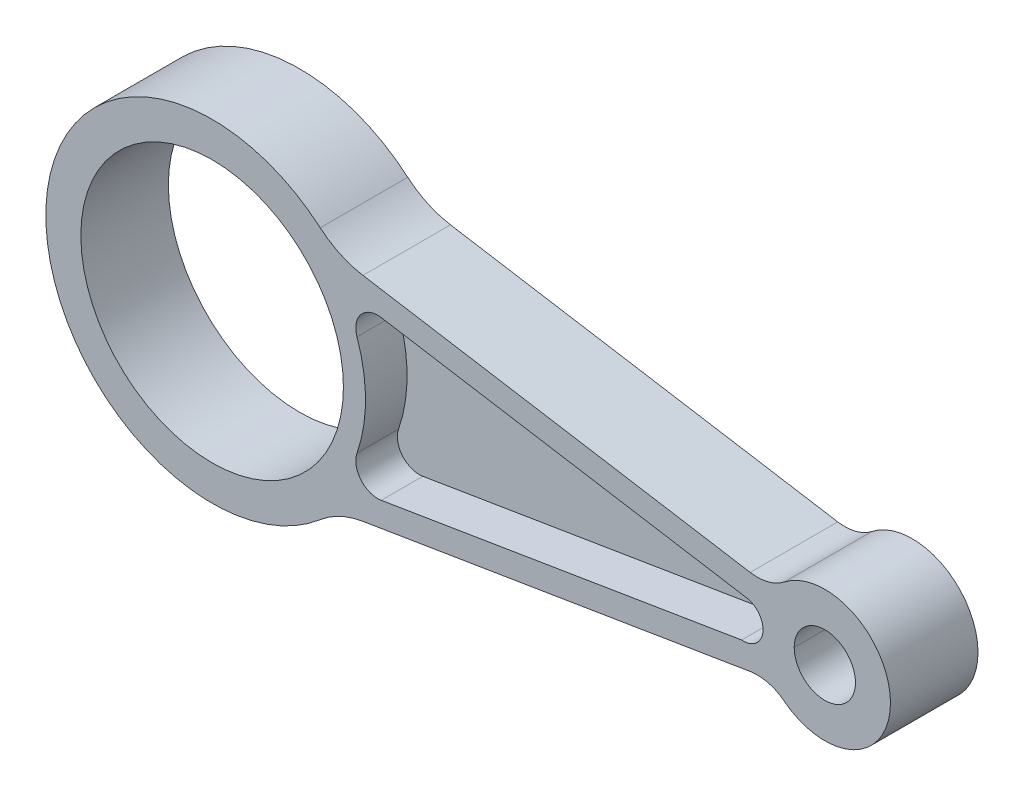
ISO-10303-21;
HEADER;
FILE_DESCRIPTION(('STEP AP214'),'2;1');
FILE_NAME('part.step','',(''),(''),'','','');
FILE_SCHEMA(('AUTOMOTIVE_DESIGN { 1 0 10303 214 1 1 1 1 }'));
ENDSEC;
DATA;
#1=APPLICATION_CONTEXT('core data for automotive mechanical design processes');
#2=APPLICATION_PROTOCOL_DEFINITION('international standard','automotive_design',2000,#1);
#3=PRODUCT_CONTEXT('',#1,'mechanical');
#4=PRODUCT('Part','Part','',(#3));
#5=PRODUCT_RELATED_PRODUCT_CATEGORY('part','',(#4));
#6=PRODUCT_DEFINITION_FORMATION('','',#4);
#7=PRODUCT_DEFINITION_CONTEXT('part definition',#1,'design');
#8=PRODUCT_DEFINITION('design','',#6,#7);
#9=PRODUCT_DEFINITION_SHAPE('','',#8);
#10=(LENGTH_UNIT() NAMED_UNIT(*) SI_UNIT(.MILLI.,.METRE.));
#11=(NAMED_UNIT(*) PLANE_ANGLE_UNIT() SI_UNIT($,.RADIAN.));
#12=(NAMED_UNIT(*) SI_UNIT($,.STERADIAN.) SOLID_ANGLE_UNIT());
#13=UNCERTAINTY_MEASURE_WITH_UNIT(LENGTH_MEASURE(1.E-05),#10,'distance_accuracy_value','');
#14=(GEOMETRIC_REPRESENTATION_CONTEXT(3) GLOBAL_UNCERTAINTY_ASSIGNED_CONTEXT((#13)) GLOBAL_UNIT_ASSIGNED_CONTEXT((#10,
#11,#12)) REPRESENTATION_CONTEXT('',''));
#15=CARTESIAN_POINT('',(0.,0.,0.));
#16=DIRECTION('',(0.,0.,1.));
#17=DIRECTION('',(1.,0.,0.));
#18=AXIS2_PLACEMENT_3D('',#15,#16,#17);
#19=CARTESIAN_POINT('',(140.,0.,10.));
#20=DIRECTION('',(0.,0.,-1.));
#21=DIRECTION('',(-1.,0.,0.));
#22=AXIS2_PLACEMENT_3D('',#19,#20,#21);
#23=CYLINDRICAL_SURFACE('',#22,7.00000000000001);
#24=CARTESIAN_POINT('',(140.,0.,10.));
#25=DIRECTION('',(0.,0.,1.));
#26=DIRECTION('',(1.,0.,0.));
#27=AXIS2_PLACEMENT_3D('',#24,#25,#26);
#28=CIRCLE('',#27,7.00000000000001);
#29=CARTESIAN_POINT('',(133.,0.,10.));
#30=VERTEX_POINT('',#29);
#31=CARTESIAN_POINT('',(147.,0.,10.));
#32=VERTEX_POINT('',#31);
#33=EDGE_CURVE('E293',#30,#32,#28,.T.);
#34=ORIENTED_EDGE('',*,*,#33,.T.);
#35=DIRECTION('',(0.,0.,-1.));
#36=VECTOR('',#35,1.);
#37=CARTESIAN_POINT('',(147.,0.,10.));
#38=LINE('',#37,#36);
#39=CARTESIAN_POINT('',(147.,0.,-10.));
#40=VERTEX_POINT('',#39);
#41=EDGE_CURVE('E11',#32,#40,#38,.T.);
#42=ORIENTED_EDGE('',*,*,#41,.T.);
#43=CARTESIAN_POINT('',(140.,0.,-10.));
#44=DIRECTION('',(0.,0.,1.));
#45=DIRECTION('',(1.,0.,0.));
#46=AXIS2_PLACEMENT_3D('',#43,#44,#45);
#47=CIRCLE('',#46,7.00000000000001);
#48=CARTESIAN_POINT('',(133.,0.,-10.));
#49=VERTEX_POINT('',#48);
#50=EDGE_CURVE('E297',#49,#40,#47,.T.);
#51=ORIENTED_EDGE('',*,*,#50,.F.);
#52=DIRECTION('',(0.,0.,1.));
#53=VECTOR('',#52,1.);
#54=CARTESIAN_POINT('',(133.,0.,10.));
#55=LINE('',#54,#53);
#56=EDGE_CURVE('E49',#49,#30,#55,.T.);
#57=ORIENTED_EDGE('',*,*,#56,.T.);
#58=EDGE_LOOP('',(#34,#42,#51,#57));
#59=FACE_BOUND('',#58,.T.);
#60=ADVANCED_FACE('F40',(#59),#23,.F.);
#61=CARTESIAN_POINT('',(0.,0.,-10.));
#62=DIRECTION('',(0.,0.,1.));
#63=DIRECTION('',(1.,0.,0.));
#64=AXIS2_PLACEMENT_3D('',#61,#62,#63);
#65=PLANE('',#64);
#66=ORIENTED_EDGE('',*,*,#50,.T.);
#67=EDGE_CURVE('E282',#40,#49,#47,.T.);
#68=ORIENTED_EDGE('',*,*,#67,.T.);
#69=EDGE_LOOP('',(#66,#68));
#70=FACE_BOUND('',#69,.T.);
#71=CARTESIAN_POINT('',(0.,0.,-10.));
#72=DIRECTION('',(0.,0.,1.));
#73=DIRECTION('',(1.,0.,0.));
#74=AXIS2_PLACEMENT_3D('',#71,#72,#73);
#75=CIRCLE('',#74,30.);
#76=CARTESIAN_POINT('',(30.,0.,-10.));
#77=VERTEX_POINT('',#76);
#78=EDGE_CURVE('E295',#77,#77,#75,.T.);
#79=ORIENTED_EDGE('',*,*,#78,.T.);
#80=EDGE_LOOP('',(#79));
#81=FACE_BOUND('',#80,.T.);
#82=CARTESIAN_POINT('',(0.,0.,-10.));
#83=DIRECTION('',(0.,0.,1.));
#84=DIRECTION('',(1.,0.,0.));
#85=AXIS2_PLACEMENT_3D('',#82,#83,#84);
#86=CIRCLE('',#85,38.);
#87=CARTESIAN_POINT('',(24.7015684624917,28.8761582537019,-10.));
#88=VERTEX_POINT('',#87);
#89=CARTESIAN_POINT('',(24.7015684624917,-28.8761582537019,-10.));
#90=VERTEX_POINT('',#89);
#91=EDGE_CURVE('E303',#88,#90,#86,.T.);
#92=ORIENTED_EDGE('',*,*,#91,.F.);
#93=CARTESIAN_POINT('',(37.7023939690662,44.0741362819661,-10.));
#94=DIRECTION('',(0.,0.,1.));
#95=DIRECTION('',(1.,0.,0.));
#96=AXIS2_PLACEMENT_3D('',#93,#94,#95);
#97=CIRCLE('',#96,20.);
#98=CARTESIAN_POINT('',(34.4601422308991,24.3386909192094,-10.));
#99=VERTEX_POINT('',#98);
#100=EDGE_CURVE('E342',#88,#99,#97,.T.);
#101=ORIENTED_EDGE('',*,*,#100,.T.);
#102=DIRECTION('',(-0.986772268137831,0.162112586908358,0.));
#103=VECTOR('',#102,1.);
#104=CARTESIAN_POINT('',(28.3093472341479,25.3491786686757,-10.));
#105=LINE('',#104,#103);
#106=CARTESIAN_POINT('',(122.947631974271,9.8014604613698,-10.));
#107=VERTEX_POINT('',#106);
#108=EDGE_CURVE('E310',#107,#99,#105,.T.);
#109=ORIENTED_EDGE('',*,*,#108,.F.);
#110=CARTESIAN_POINT('',(124.568757843354,19.6691831427481,-10.));
#111=DIRECTION('',(0.,0.,1.));
#112=DIRECTION('',(1.,0.,0.));
#113=AXIS2_PLACEMENT_3D('',#110,#111,#112);
#114=CIRCLE('',#113,10.);
#115=CARTESIAN_POINT('',(130.741254706013,11.8015098856489,-10.));
#116=VERTEX_POINT('',#115);
#117=EDGE_CURVE('E361',#107,#116,#114,.T.);
#118=ORIENTED_EDGE('',*,*,#117,.T.);
#119=CARTESIAN_POINT('',(140.,0.,-10.));
#120=DIRECTION('',(0.,0.,1.));
#121=DIRECTION('',(1.,0.,0.));
#122=AXIS2_PLACEMENT_3D('',#119,#120,#121);
#123=CIRCLE('',#122,15.);
#124=CARTESIAN_POINT('',(130.741254706013,-11.8015098856489,-10.));
#125=VERTEX_POINT('',#124);
#126=EDGE_CURVE('E324',#125,#116,#123,.T.);
#127=ORIENTED_EDGE('',*,*,#126,.F.);
#128=CARTESIAN_POINT('',(124.568757843354,-19.6691831427481,-10.));
#129=DIRECTION('',(0.,0.,1.));
#130=DIRECTION('',(1.,0.,0.));
#131=AXIS2_PLACEMENT_3D('',#128,#129,#130);
#132=CIRCLE('',#131,10.);
#133=CARTESIAN_POINT('',(122.947631974271,-9.8014604613698,-10.));
#134=VERTEX_POINT('',#133);
#135=EDGE_CURVE('E357',#125,#134,#132,.T.);
#136=ORIENTED_EDGE('',*,*,#135,.T.);
#137=DIRECTION('',(0.986772268137831,0.162112586908358,0.));
#138=VECTOR('',#137,1.);
#139=CARTESIAN_POINT('',(28.3093472341479,-25.3491786686757,-10.));
#140=LINE('',#139,#138);
#141=CARTESIAN_POINT('',(34.4601422308991,-24.3386909192094,-10.));
#142=VERTEX_POINT('',#141);
#143=EDGE_CURVE('E321',#142,#134,#140,.T.);
#144=ORIENTED_EDGE('',*,*,#143,.F.);
#145=CARTESIAN_POINT('',(37.7023939690662,-44.0741362819661,-10.));
#146=DIRECTION('',(0.,0.,1.));
#147=DIRECTION('',(1.,0.,0.));
#148=AXIS2_PLACEMENT_3D('',#145,#146,#147);
#149=CIRCLE('',#148,20.);
#150=EDGE_CURVE('E338',#142,#90,#149,.T.);
#151=ORIENTED_EDGE('',*,*,#150,.T.);
#152=EDGE_LOOP('',(#92,#101,#109,#118,#127,#136,#144,#151));
#153=FACE_BOUND('',#152,.T.);
#154=CARTESIAN_POINT('',(37.8281289394313,-13.1446257892293,-10.));
#155=DIRECTION('',(0.,0.,1.));
#156=DIRECTION('',(1.,0.,0.));
#157=AXIS2_PLACEMENT_3D('',#154,#155,#156);
#158=CIRCLE('',#157,5.);
#159=CARTESIAN_POINT('',(33.1051421602208,-11.5034689157397,-10.));
#160=VERTEX_POINT('',#159);
#161=CARTESIAN_POINT('',(38.6386918739731,-18.0784871299184,-10.));
#162=VERTEX_POINT('',#161);
#163=EDGE_CURVE('E207',#160,#162,#158,.T.);
#164=ORIENTED_EDGE('',*,*,#163,.T.);
#165=DIRECTION('',(0.986772268137831,0.162112586908358,0.));
#166=VECTOR('',#165,1.);
#167=CARTESIAN_POINT('',(38.6386918739731,-18.0784871299184,-10.));
#168=LINE('',#167,#166);
#169=CARTESIAN_POINT('',(120.9865558741,-4.54990947275478,-10.));
#170=VERTEX_POINT('',#169);
#171=EDGE_CURVE('E212',#162,#170,#168,.T.);
#172=ORIENTED_EDGE('',*,*,#171,.T.);
#173=CARTESIAN_POINT('',(121.374871533547,-0.0666951182287688,-10.));
#174=DIRECTION('',(0.,0.,1.));
#175=DIRECTION('',(1.,0.,0.));
#176=AXIS2_PLACEMENT_3D('',#173,#174,#175);
#177=CIRCLE('',#176,4.5);
#178=CARTESIAN_POINT('',(121.848393563211,4.40832185240088,-10.));
#179=VERTEX_POINT('',#178);
#180=EDGE_CURVE('E215',#170,#179,#177,.T.);
#181=ORIENTED_EDGE('',*,*,#180,.T.);
#182=DIRECTION('',(-0.986772268137831,0.162112586908358,0.));
#183=VECTOR('',#182,1.);
#184=CARTESIAN_POINT('',(38.6386918739731,18.0784871299184,-10.));
#185=LINE('',#184,#183);
#186=CARTESIAN_POINT('',(38.6386918739731,18.0784871299184,-10.));
#187=VERTEX_POINT('',#186);
#188=EDGE_CURVE('E230',#179,#187,#185,.T.);
#189=ORIENTED_EDGE('',*,*,#188,.T.);
#190=CARTESIAN_POINT('',(37.8281289394313,13.1446257892293,-10.));
#191=DIRECTION('',(0.,0.,1.));
#192=DIRECTION('',(-1.,0.,0.));
#193=AXIS2_PLACEMENT_3D('',#190,#191,#192);
#194=CIRCLE('',#193,5.);
#195=CARTESIAN_POINT('',(33.1051421602208,11.5034689157396,-10.));
#196=VERTEX_POINT('',#195);
#197=EDGE_CURVE('E227',#187,#196,#194,.T.);
#198=ORIENTED_EDGE('',*,*,#197,.T.);
#199=CARTESIAN_POINT('',(0.,0.,-10.));
#200=DIRECTION('',(0.,0.,-1.));
#201=DIRECTION('',(1.,0.,0.));
#202=AXIS2_PLACEMENT_3D('',#199,#200,#201);
#203=CIRCLE('',#202,35.0468291653299);
#204=EDGE_CURVE('E225',#196,#160,#203,.T.);
#205=ORIENTED_EDGE('',*,*,#204,.T.);
#206=EDGE_LOOP('',(#164,#172,#181,#189,#198,#205));
#207=FACE_BOUND('',#206,.T.);
#208=ADVANCED_FACE('F389',(#70,#81,#153,#207),#65,.F.);
#209=CARTESIAN_POINT('',(0.,0.,10.));
#210=DIRECTION('',(0.,0.,1.));
#211=DIRECTION('',(1.,0.,0.));
#212=AXIS2_PLACEMENT_3D('',#209,#210,#211);
#213=PLANE('',#212);
#214=CARTESIAN_POINT('',(37.8281289394313,-13.1446257892293,10.));
#215=DIRECTION('',(0.,0.,1.));
#216=DIRECTION('',(1.,0.,0.));
#217=AXIS2_PLACEMENT_3D('',#214,#215,#216);
#218=CIRCLE('',#217,5.);
#219=CARTESIAN_POINT('',(33.1051421602208,-11.5034689157397,10.));
#220=VERTEX_POINT('',#219);
#221=CARTESIAN_POINT('',(38.6386918739731,-18.0784871299184,10.));
#222=VERTEX_POINT('',#221);
#223=EDGE_CURVE('E237',#220,#222,#218,.T.);
#224=ORIENTED_EDGE('',*,*,#223,.F.);
#225=CARTESIAN_POINT('',(0.,0.,10.));
#226=DIRECTION('',(0.,0.,-1.));
#227=DIRECTION('',(1.,0.,0.));
#228=AXIS2_PLACEMENT_3D('',#225,#226,#227);
#229=CIRCLE('',#228,35.0468291653299);
#230=CARTESIAN_POINT('',(33.1051421602208,11.5034689157396,10.));
#231=VERTEX_POINT('',#230);
#232=EDGE_CURVE('E249',#231,#220,#229,.T.);
#233=ORIENTED_EDGE('',*,*,#232,.F.);
#234=CARTESIAN_POINT('',(37.8281289394313,13.1446257892293,10.));
#235=DIRECTION('',(0.,0.,1.));
#236=DIRECTION('',(-1.,0.,0.));
#237=AXIS2_PLACEMENT_3D('',#234,#235,#236);
#238=CIRCLE('',#237,5.);
#239=CARTESIAN_POINT('',(38.6386918739731,18.0784871299184,10.));
#240=VERTEX_POINT('',#239);
#241=EDGE_CURVE('E275',#240,#231,#238,.T.);
#242=ORIENTED_EDGE('',*,*,#241,.F.);
#243=DIRECTION('',(-0.986772268137831,0.162112586908358,0.));
#244=VECTOR('',#243,1.);
#245=CARTESIAN_POINT('',(38.6386918739731,18.0784871299184,10.));
#246=LINE('',#245,#244);
#247=CARTESIAN_POINT('',(121.848393563211,4.40832185240088,10.));
#248=VERTEX_POINT('',#247);
#249=EDGE_CURVE('E272',#248,#240,#246,.T.);
#250=ORIENTED_EDGE('',*,*,#249,.F.);
#251=CARTESIAN_POINT('',(121.374871533547,-0.0666951182287688,10.));
#252=DIRECTION('',(0.,0.,1.));
#253=DIRECTION('',(1.,0.,0.));
#254=AXIS2_PLACEMENT_3D('',#251,#252,#253);
#255=CIRCLE('',#254,4.5);
#256=CARTESIAN_POINT('',(120.9865558741,-4.54990947275478,10.));
#257=VERTEX_POINT('',#256);
#258=EDGE_CURVE('E269',#257,#248,#255,.T.);
#259=ORIENTED_EDGE('',*,*,#258,.F.);
#260=DIRECTION('',(0.986772268137831,0.162112586908358,0.));
#261=VECTOR('',#260,1.);
#262=CARTESIAN_POINT('',(38.6386918739731,-18.0784871299184,10.));
#263=LINE('',#262,#261);
#264=EDGE_CURVE('E266',#222,#257,#263,.T.);
#265=ORIENTED_EDGE('',*,*,#264,.F.);
#266=EDGE_LOOP('',(#224,#233,#242,#250,#259,#265));
#267=FACE_BOUND('',#266,.T.);
#268=CARTESIAN_POINT('',(0.,0.,10.));
#269=DIRECTION('',(0.,0.,1.));
#270=DIRECTION('',(1.,0.,0.));
#271=AXIS2_PLACEMENT_3D('',#268,#269,#270);
#272=CIRCLE('',#271,30.);
#273=CARTESIAN_POINT('',(30.,0.,10.));
#274=VERTEX_POINT('',#273);
#275=EDGE_CURVE('E300',#274,#274,#272,.T.);
#276=ORIENTED_EDGE('',*,*,#275,.F.);
#277=EDGE_LOOP('',(#276));
#278=FACE_BOUND('',#277,.T.);
#279=CARTESIAN_POINT('',(140.,0.,10.));
#280=DIRECTION('',(0.,0.,1.));
#281=DIRECTION('',(1.,0.,0.));
#282=AXIS2_PLACEMENT_3D('',#279,#280,#281);
#283=CIRCLE('',#282,15.);
#284=CARTESIAN_POINT('',(130.741254706013,-11.8015098856489,10.));
#285=VERTEX_POINT('',#284);
#286=CARTESIAN_POINT('',(130.741254706013,11.8015098856489,10.));
#287=VERTEX_POINT('',#286);
#288=EDGE_CURVE('E313',#285,#287,#283,.T.);
#289=ORIENTED_EDGE('',*,*,#288,.T.);
#290=CARTESIAN_POINT('',(124.568757843354,19.6691831427481,10.));
#291=DIRECTION('',(0.,0.,1.));
#292=DIRECTION('',(1.,0.,0.));
#293=AXIS2_PLACEMENT_3D('',#290,#291,#292);
#294=CIRCLE('',#293,10.);
#295=CARTESIAN_POINT('',(122.947631974271,9.8014604613698,10.));
#296=VERTEX_POINT('',#295);
#297=EDGE_CURVE('E363',#287,#296,#294,.F.);
#298=ORIENTED_EDGE('',*,*,#297,.T.);
#299=DIRECTION('',(-0.986772268137831,0.162112586908358,0.));
#300=VECTOR('',#299,1.);
#301=CARTESIAN_POINT('',(28.3093472341479,25.3491786686757,10.));
#302=LINE('',#301,#300);
#303=CARTESIAN_POINT('',(34.4601422308991,24.3386909192094,10.));
#304=VERTEX_POINT('',#303);
#305=EDGE_CURVE('E316',#296,#304,#302,.T.);
#306=ORIENTED_EDGE('',*,*,#305,.T.);
#307=CARTESIAN_POINT('',(37.7023939690662,44.0741362819661,10.));
#308=DIRECTION('',(0.,0.,1.));
#309=DIRECTION('',(1.,0.,0.));
#310=AXIS2_PLACEMENT_3D('',#307,#308,#309);
#311=CIRCLE('',#310,20.);
#312=CARTESIAN_POINT('',(24.7015684624917,28.8761582537019,10.));
#313=VERTEX_POINT('',#312);
#314=EDGE_CURVE('E345',#304,#313,#311,.F.);
#315=ORIENTED_EDGE('',*,*,#314,.T.);
#316=CARTESIAN_POINT('',(0.,0.,10.));
#317=DIRECTION('',(0.,0.,1.));
#318=DIRECTION('',(1.,0.,0.));
#319=AXIS2_PLACEMENT_3D('',#316,#317,#318);
#320=CIRCLE('',#319,38.);
#321=CARTESIAN_POINT('',(24.7015684624917,-28.8761582537019,10.));
#322=VERTEX_POINT('',#321);
#323=EDGE_CURVE('E306',#313,#322,#320,.T.);
#324=ORIENTED_EDGE('',*,*,#323,.T.);
#325=CARTESIAN_POINT('',(37.7023939690662,-44.0741362819661,10.));
#326=DIRECTION('',(0.,0.,1.));
#327=DIRECTION('',(1.,0.,0.));
#328=AXIS2_PLACEMENT_3D('',#325,#326,#327);
#329=CIRCLE('',#328,20.);
#330=CARTESIAN_POINT('',(34.4601422308991,-24.3386909192094,10.));
#331=VERTEX_POINT('',#330);
#332=EDGE_CURVE('E340',#322,#331,#329,.F.);
#333=ORIENTED_EDGE('',*,*,#332,.T.);
#334=DIRECTION('',(0.986772268137831,0.162112586908358,0.));
#335=VECTOR('',#334,1.);
#336=CARTESIAN_POINT('',(28.3093472341479,-25.3491786686757,10.));
#337=LINE('',#336,#335);
#338=CARTESIAN_POINT('',(122.947631974271,-9.8014604613698,10.));
#339=VERTEX_POINT('',#338);
#340=EDGE_CURVE('E309',#331,#339,#337,.T.);
#341=ORIENTED_EDGE('',*,*,#340,.T.);
#342=CARTESIAN_POINT('',(124.568757843354,-19.6691831427481,10.));
#343=DIRECTION('',(0.,0.,1.));
#344=DIRECTION('',(1.,0.,0.));
#345=AXIS2_PLACEMENT_3D('',#342,#343,#344);
#346=CIRCLE('',#345,10.);
#347=EDGE_CURVE('E359',#339,#285,#346,.F.);
#348=ORIENTED_EDGE('',*,*,#347,.T.);
#349=EDGE_LOOP('',(#289,#298,#306,#315,#324,#333,#341,#348));
#350=FACE_BOUND('',#349,.T.);
#351=ORIENTED_EDGE('',*,*,#33,.F.);
#352=EDGE_CURVE('E296',#32,#30,#28,.T.);
#353=ORIENTED_EDGE('',*,*,#352,.F.);
#354=EDGE_LOOP('',(#351,#353));
#355=FACE_BOUND('',#354,.T.);
#356=ADVANCED_FACE('F371',(#267,#278,#350,#355),#213,.T.);
#357=CARTESIAN_POINT('',(0.,0.,10.));
#358=DIRECTION('',(0.,0.,-1.));
#359=DIRECTION('',(-1.,0.,0.));
#360=AXIS2_PLACEMENT_3D('',#357,#358,#359);
#361=CYLINDRICAL_SURFACE('',#360,38.);
#362=ORIENTED_EDGE('',*,*,#91,.T.);
#363=DIRECTION('',(0.,0.,-1.));
#364=VECTOR('',#363,1.);
#365=CARTESIAN_POINT('',(24.7015684624917,-28.8761582537019,10.));
#366=LINE('',#365,#364);
#367=EDGE_CURVE('E333',#90,#322,#366,.F.);
#368=ORIENTED_EDGE('',*,*,#367,.T.);
#369=ORIENTED_EDGE('',*,*,#323,.F.);
#370=DIRECTION('',(0.,0.,-1.));
#371=VECTOR('',#370,1.);
#372=CARTESIAN_POINT('',(24.7015684624917,28.8761582537019,10.));
#373=LINE('',#372,#371);
#374=EDGE_CURVE('E330',#313,#88,#373,.T.);
#375=ORIENTED_EDGE('',*,*,#374,.T.);
#376=EDGE_LOOP('',(#362,#368,#369,#375));
#377=FACE_BOUND('',#376,.T.);
#378=ADVANCED_FACE('F398',(#377),#361,.T.);
#379=CARTESIAN_POINT('',(28.3093472341479,-25.3491786686757,10.));
#380=DIRECTION('',(-0.162112586908358,0.986772268137831,0.));
#381=DIRECTION('',(-0.986772268137831,-0.162112586908358,0.));
#382=AXIS2_PLACEMENT_3D('',#379,#380,#381);
#383=PLANE('',#382);
#384=ORIENTED_EDGE('',*,*,#143,.T.);
#385=DIRECTION('',(0.,0.,1.));
#386=VECTOR('',#385,1.);
#387=CARTESIAN_POINT('',(122.947631974271,-9.8014604613698,10.));
#388=LINE('',#387,#386);
#389=EDGE_CURVE('E352',#134,#339,#388,.T.);
#390=ORIENTED_EDGE('',*,*,#389,.T.);
#391=ORIENTED_EDGE('',*,*,#340,.F.);
#392=DIRECTION('',(0.,0.,1.));
#393=VECTOR('',#392,1.);
#394=CARTESIAN_POINT('',(34.4601422308991,-24.3386909192094,-10.));
#395=LINE('',#394,#393);
#396=EDGE_CURVE('E318',#331,#142,#395,.F.);
#397=ORIENTED_EDGE('',*,*,#396,.T.);
#398=EDGE_LOOP('',(#384,#390,#391,#397));
#399=FACE_BOUND('',#398,.T.);
#400=ADVANCED_FACE('F409',(#399),#383,.F.);
#401=CARTESIAN_POINT('',(140.,0.,10.));
#402=DIRECTION('',(0.,0.,-1.));
#403=DIRECTION('',(-1.,0.,0.));
#404=AXIS2_PLACEMENT_3D('',#401,#402,#403);
#405=CYLINDRICAL_SURFACE('',#404,15.);
#406=ORIENTED_EDGE('',*,*,#288,.F.);
#407=DIRECTION('',(0.,0.,-1.));
#408=VECTOR('',#407,1.);
#409=CARTESIAN_POINT('',(130.741254706013,-11.8015098856489,10.));
#410=LINE('',#409,#408);
#411=EDGE_CURVE('E349',#285,#125,#410,.T.);
#412=ORIENTED_EDGE('',*,*,#411,.T.);
#413=ORIENTED_EDGE('',*,*,#126,.T.);
#414=DIRECTION('',(0.,0.,-1.));
#415=VECTOR('',#414,1.);
#416=CARTESIAN_POINT('',(130.741254706013,11.8015098856489,10.));
#417=LINE('',#416,#415);
#418=EDGE_CURVE('E347',#116,#287,#417,.F.);
#419=ORIENTED_EDGE('',*,*,#418,.T.);
#420=EDGE_LOOP('',(#406,#412,#413,#419));
#421=FACE_BOUND('',#420,.T.);
#422=ADVANCED_FACE('F405',(#421),#405,.T.);
#423=CARTESIAN_POINT('',(28.3093472341479,25.3491786686757,10.));
#424=DIRECTION('',(-0.162112586908358,-0.986772268137831,0.));
#425=DIRECTION('',(0.986772268137831,-0.162112586908358,0.));
#426=AXIS2_PLACEMENT_3D('',#423,#424,#425);
#427=PLANE('',#426);
#428=ORIENTED_EDGE('',*,*,#305,.F.);
#429=DIRECTION('',(0.,0.,1.));
#430=VECTOR('',#429,1.);
#431=CARTESIAN_POINT('',(122.947631974271,9.8014604613698,-10.));
#432=LINE('',#431,#430);
#433=EDGE_CURVE('E354',#296,#107,#432,.F.);
#434=ORIENTED_EDGE('',*,*,#433,.T.);
#435=ORIENTED_EDGE('',*,*,#108,.T.);
#436=DIRECTION('',(0.,0.,1.));
#437=VECTOR('',#436,1.);
#438=CARTESIAN_POINT('',(34.4601422308991,24.3386909192094,10.));
#439=LINE('',#438,#437);
#440=EDGE_CURVE('E335',#99,#304,#439,.T.);
#441=ORIENTED_EDGE('',*,*,#440,.T.);
#442=EDGE_LOOP('',(#428,#434,#435,#441));
#443=FACE_BOUND('',#442,.T.);
#444=ADVANCED_FACE('F384',(#443),#427,.F.);
#445=CARTESIAN_POINT('',(0.,0.,10.));
#446=DIRECTION('',(0.,0.,-1.));
#447=DIRECTION('',(-1.,0.,0.));
#448=AXIS2_PLACEMENT_3D('',#445,#446,#447);
#449=CYLINDRICAL_SURFACE('',#448,30.);
#450=ORIENTED_EDGE('',*,*,#275,.T.);
#451=EDGE_LOOP('',(#450));
#452=FACE_BOUND('',#451,.T.);
#453=ORIENTED_EDGE('',*,*,#78,.F.);
#454=EDGE_LOOP('',(#453));
#455=FACE_BOUND('',#454,.T.);
#456=ADVANCED_FACE('F375',(#452,#455),#449,.F.);
#457=ORIENTED_EDGE('',*,*,#41,.F.);
#458=ORIENTED_EDGE('',*,*,#352,.T.);
#459=ORIENTED_EDGE('',*,*,#56,.F.);
#460=ORIENTED_EDGE('',*,*,#67,.F.);
#461=EDGE_LOOP('',(#457,#458,#459,#460));
#462=FACE_BOUND('',#461,.T.);
#463=ADVANCED_FACE('F372',(#462),#23,.F.);
#464=CARTESIAN_POINT('',(37.7023939690662,-44.0741362819661,10.));
#465=DIRECTION('',(0.,0.,-1.));
#466=DIRECTION('',(-1.,0.,0.));
#467=AXIS2_PLACEMENT_3D('',#464,#465,#466);
#468=CYLINDRICAL_SURFACE('',#467,20.);
#469=ORIENTED_EDGE('',*,*,#332,.F.);
#470=ORIENTED_EDGE('',*,*,#367,.F.);
#471=ORIENTED_EDGE('',*,*,#150,.F.);
#472=ORIENTED_EDGE('',*,*,#396,.F.);
#473=EDGE_LOOP('',(#469,#470,#471,#472));
#474=FACE_BOUND('',#473,.T.);
#475=ADVANCED_FACE('F374',(#474),#468,.F.);
#476=CARTESIAN_POINT('',(37.7023939690662,44.0741362819661,10.));
#477=DIRECTION('',(0.,0.,-1.));
#478=DIRECTION('',(-1.,0.,0.));
#479=AXIS2_PLACEMENT_3D('',#476,#477,#478);
#480=CYLINDRICAL_SURFACE('',#479,20.);
#481=ORIENTED_EDGE('',*,*,#314,.F.);
#482=ORIENTED_EDGE('',*,*,#440,.F.);
#483=ORIENTED_EDGE('',*,*,#100,.F.);
#484=ORIENTED_EDGE('',*,*,#374,.F.);
#485=EDGE_LOOP('',(#481,#482,#483,#484));
#486=FACE_BOUND('',#485,.T.);
#487=ADVANCED_FACE('F381',(#486),#480,.F.);
#488=CARTESIAN_POINT('',(124.568757843354,-19.6691831427481,10.));
#489=DIRECTION('',(0.,0.,-1.));
#490=DIRECTION('',(-1.,0.,0.));
#491=AXIS2_PLACEMENT_3D('',#488,#489,#490);
#492=CYLINDRICAL_SURFACE('',#491,10.);
#493=ORIENTED_EDGE('',*,*,#347,.F.);
#494=ORIENTED_EDGE('',*,*,#389,.F.);
#495=ORIENTED_EDGE('',*,*,#135,.F.);
#496=ORIENTED_EDGE('',*,*,#411,.F.);
#497=EDGE_LOOP('',(#493,#494,#495,#496));
#498=FACE_BOUND('',#497,.T.);
#499=ADVANCED_FACE('F418',(#498),#492,.F.);
#500=CARTESIAN_POINT('',(124.568757843354,19.6691831427481,10.));
#501=DIRECTION('',(0.,0.,-1.));
#502=DIRECTION('',(-1.,0.,0.));
#503=AXIS2_PLACEMENT_3D('',#500,#501,#502);
#504=CYLINDRICAL_SURFACE('',#503,10.);
#505=ORIENTED_EDGE('',*,*,#297,.F.);
#506=ORIENTED_EDGE('',*,*,#418,.F.);
#507=ORIENTED_EDGE('',*,*,#117,.F.);
#508=ORIENTED_EDGE('',*,*,#433,.F.);
#509=EDGE_LOOP('',(#505,#506,#507,#508));
#510=FACE_BOUND('',#509,.T.);
#511=ADVANCED_FACE('F42',(#510),#504,.F.);
#512=CARTESIAN_POINT('',(37.8281289394313,-13.1446257892293,0.5));
#513=DIRECTION('',(0.,0.,1.));
#514=DIRECTION('',(1.,0.,0.));
#515=AXIS2_PLACEMENT_3D('',#512,#513,#514);
#516=CYLINDRICAL_SURFACE('',#515,5.);
#517=ORIENTED_EDGE('',*,*,#223,.T.);
#518=DIRECTION('',(0.,0.,1.));
#519=VECTOR('',#518,1.);
#520=CARTESIAN_POINT('',(38.6386918739731,-18.0784871299184,0.5));
#521=LINE('',#520,#519);
#522=CARTESIAN_POINT('',(38.6386918739731,-18.0784871299184,0.5));
#523=VERTEX_POINT('',#522);
#524=EDGE_CURVE('E264',#523,#222,#521,.T.);
#525=ORIENTED_EDGE('',*,*,#524,.F.);
#526=CARTESIAN_POINT('',(37.8281289394313,-13.1446257892293,0.5));
#527=DIRECTION('',(0.,0.,1.));
#528=DIRECTION('',(1.,0.,0.));
#529=AXIS2_PLACEMENT_3D('',#526,#527,#528);
#530=CIRCLE('',#529,5.);
#531=CARTESIAN_POINT('',(33.1051421602208,-11.5034689157397,0.5));
#532=VERTEX_POINT('',#531);
#533=EDGE_CURVE('E245',#532,#523,#530,.T.);
#534=ORIENTED_EDGE('',*,*,#533,.F.);
#535=DIRECTION('',(0.,0.,1.));
#536=VECTOR('',#535,1.);
#537=CARTESIAN_POINT('',(33.1051421602208,-11.5034689157397,0.5));
#538=LINE('',#537,#536);
#539=EDGE_CURVE('E280',#532,#220,#538,.T.);
#540=ORIENTED_EDGE('',*,*,#539,.T.);
#541=EDGE_LOOP('',(#517,#525,#534,#540));
#542=FACE_BOUND('',#541,.T.);
#543=ADVANCED_FACE('F425',(#542),#516,.F.);
#544=CARTESIAN_POINT('',(0.,0.,0.5));
#545=DIRECTION('',(0.,0.,1.));
#546=DIRECTION('',(1.,0.,0.));
#547=AXIS2_PLACEMENT_3D('',#544,#545,#546);
#548=CYLINDRICAL_SURFACE('',#547,35.0468291653299);
#549=ORIENTED_EDGE('',*,*,#232,.T.);
#550=ORIENTED_EDGE('',*,*,#539,.F.);
#551=CARTESIAN_POINT('',(0.,0.,0.5));
#552=DIRECTION('',(0.,0.,-1.));
#553=DIRECTION('',(1.,0.,0.));
#554=AXIS2_PLACEMENT_3D('',#551,#552,#553);
#555=CIRCLE('',#554,35.0468291653299);
#556=CARTESIAN_POINT('',(33.1051421602208,11.5034689157396,0.5));
#557=VERTEX_POINT('',#556);
#558=EDGE_CURVE('E261',#557,#532,#555,.T.);
#559=ORIENTED_EDGE('',*,*,#558,.F.);
#560=DIRECTION('',(0.,0.,1.));
#561=VECTOR('',#560,1.);
#562=CARTESIAN_POINT('',(33.1051421602208,11.5034689157396,0.5));
#563=LINE('',#562,#561);
#564=EDGE_CURVE('E283',#557,#231,#563,.T.);
#565=ORIENTED_EDGE('',*,*,#564,.T.);
#566=EDGE_LOOP('',(#549,#550,#559,#565));
#567=FACE_BOUND('',#566,.T.);
#568=ADVANCED_FACE('F486',(#567),#548,.T.);
#569=CARTESIAN_POINT('',(37.8281289394313,13.1446257892293,0.5));
#570=DIRECTION('',(0.,0.,1.));
#571=DIRECTION('',(1.,0.,0.));
#572=AXIS2_PLACEMENT_3D('',#569,#570,#571);
#573=CYLINDRICAL_SURFACE('',#572,5.);
#574=ORIENTED_EDGE('',*,*,#241,.T.);
#575=ORIENTED_EDGE('',*,*,#564,.F.);
#576=CARTESIAN_POINT('',(37.8281289394313,13.1446257892293,0.5));
#577=DIRECTION('',(0.,0.,1.));
#578=DIRECTION('',(-1.,0.,0.));
#579=AXIS2_PLACEMENT_3D('',#576,#577,#578);
#580=CIRCLE('',#579,5.);
#581=CARTESIAN_POINT('',(38.6386918739731,18.0784871299184,0.5));
#582=VERTEX_POINT('',#581);
#583=EDGE_CURVE('E258',#582,#557,#580,.T.);
#584=ORIENTED_EDGE('',*,*,#583,.F.);
#585=DIRECTION('',(0.,0.,1.));
#586=VECTOR('',#585,1.);
#587=CARTESIAN_POINT('',(38.6386918739731,18.0784871299184,0.5));
#588=LINE('',#587,#586);
#589=EDGE_CURVE('E285',#582,#240,#588,.T.);
#590=ORIENTED_EDGE('',*,*,#589,.T.);
#591=EDGE_LOOP('',(#574,#575,#584,#590));
#592=FACE_BOUND('',#591,.T.);
#593=ADVANCED_FACE('F489',(#592),#573,.F.);
#594=CARTESIAN_POINT('',(38.6386918739731,18.0784871299184,0.5));
#595=DIRECTION('',(0.162112586908358,0.986772268137831,0.));
#596=DIRECTION('',(-0.986772268137831,0.162112586908358,0.));
#597=AXIS2_PLACEMENT_3D('',#594,#595,#596);
#598=PLANE('',#597);
#599=ORIENTED_EDGE('',*,*,#249,.T.);
#600=ORIENTED_EDGE('',*,*,#589,.F.);
#601=DIRECTION('',(-0.986772268137831,0.162112586908358,0.));
#602=VECTOR('',#601,1.);
#603=CARTESIAN_POINT('',(38.6386918739731,18.0784871299184,0.5));
#604=LINE('',#603,#602);
#605=CARTESIAN_POINT('',(121.848393563211,4.40832185240088,0.5));
#606=VERTEX_POINT('',#605);
#607=EDGE_CURVE('E255',#606,#582,#604,.T.);
#608=ORIENTED_EDGE('',*,*,#607,.F.);
#609=DIRECTION('',(0.,0.,1.));
#610=VECTOR('',#609,1.);
#611=CARTESIAN_POINT('',(121.848393563211,4.40832185240088,0.5));
#612=LINE('',#611,#610);
#613=EDGE_CURVE('E287',#606,#248,#612,.T.);
#614=ORIENTED_EDGE('',*,*,#613,.T.);
#615=EDGE_LOOP('',(#599,#600,#608,#614));
#616=FACE_BOUND('',#615,.T.);
#617=ADVANCED_FACE('F493',(#616),#598,.F.);
#618=CARTESIAN_POINT('',(121.374871533547,-0.0666951182287688,0.5));
#619=DIRECTION('',(0.,0.,1.));
#620=DIRECTION('',(1.,0.,0.));
#621=AXIS2_PLACEMENT_3D('',#618,#619,#620);
#622=CYLINDRICAL_SURFACE('',#621,4.5);
#623=ORIENTED_EDGE('',*,*,#258,.T.);
#624=ORIENTED_EDGE('',*,*,#613,.F.);
#625=CARTESIAN_POINT('',(121.374871533547,-0.0666951182287688,0.5));
#626=DIRECTION('',(0.,0.,1.));
#627=DIRECTION('',(1.,0.,0.));
#628=AXIS2_PLACEMENT_3D('',#625,#626,#627);
#629=CIRCLE('',#628,4.5);
#630=CARTESIAN_POINT('',(120.9865558741,-4.54990947275478,0.5));
#631=VERTEX_POINT('',#630);
#632=EDGE_CURVE('E252',#631,#606,#629,.T.);
#633=ORIENTED_EDGE('',*,*,#632,.F.);
#634=DIRECTION('',(0.,0.,1.));
#635=VECTOR('',#634,1.);
#636=CARTESIAN_POINT('',(120.9865558741,-4.54990947275478,0.5));
#637=LINE('',#636,#635);
#638=EDGE_CURVE('E289',#631,#257,#637,.T.);
#639=ORIENTED_EDGE('',*,*,#638,.T.);
#640=EDGE_LOOP('',(#623,#624,#633,#639));
#641=FACE_BOUND('',#640,.T.);
#642=ADVANCED_FACE('F497',(#641),#622,.F.);
#643=CARTESIAN_POINT('',(38.6386918739731,-18.0784871299184,0.5));
#644=DIRECTION('',(0.162112586908358,-0.986772268137831,0.));
#645=DIRECTION('',(0.986772268137831,0.162112586908358,0.));
#646=AXIS2_PLACEMENT_3D('',#643,#644,#645);
#647=PLANE('',#646);
#648=ORIENTED_EDGE('',*,*,#264,.T.);
#649=ORIENTED_EDGE('',*,*,#638,.F.);
#650=DIRECTION('',(0.986772268137831,0.162112586908358,0.));
#651=VECTOR('',#650,1.);
#652=CARTESIAN_POINT('',(38.6386918739731,-18.0784871299184,0.5));
#653=LINE('',#652,#651);
#654=EDGE_CURVE('E248',#523,#631,#653,.T.);
#655=ORIENTED_EDGE('',*,*,#654,.F.);
#656=ORIENTED_EDGE('',*,*,#524,.T.);
#657=EDGE_LOOP('',(#648,#649,#655,#656));
#658=FACE_BOUND('',#657,.T.);
#659=ADVANCED_FACE('F484',(#658),#647,.F.);
#660=CARTESIAN_POINT('',(37.8281289394313,-13.1446257892293,0.5));
#661=DIRECTION('',(0.,0.,1.));
#662=DIRECTION('',(1.,0.,0.));
#663=AXIS2_PLACEMENT_3D('',#660,#661,#662);
#664=PLANE('',#663);
#665=ORIENTED_EDGE('',*,*,#533,.T.);
#666=ORIENTED_EDGE('',*,*,#654,.T.);
#667=ORIENTED_EDGE('',*,*,#632,.T.);
#668=ORIENTED_EDGE('',*,*,#607,.T.);
#669=ORIENTED_EDGE('',*,*,#583,.T.);
#670=ORIENTED_EDGE('',*,*,#558,.T.);
#671=EDGE_LOOP('',(#665,#666,#667,#668,#669,#670));
#672=FACE_BOUND('',#671,.T.);
#673=ADVANCED_FACE('F472',(#672),#664,.T.);
#674=CARTESIAN_POINT('',(37.8281289394313,-13.1446257892293,-0.5));
#675=DIRECTION('',(0.,0.,-1.));
#676=DIRECTION('',(-1.,0.,0.));
#677=AXIS2_PLACEMENT_3D('',#674,#675,#676);
#678=CYLINDRICAL_SURFACE('',#677,5.);
#679=ORIENTED_EDGE('',*,*,#163,.F.);
#680=DIRECTION('',(0.,0.,-1.));
#681=VECTOR('',#680,1.);
#682=CARTESIAN_POINT('',(33.1051421602208,-11.5034689157397,-0.5));
#683=LINE('',#682,#681);
#684=CARTESIAN_POINT('',(33.1051421602208,-11.5034689157397,-0.5));
#685=VERTEX_POINT('',#684);
#686=EDGE_CURVE('E192',#685,#160,#683,.T.);
#687=ORIENTED_EDGE('',*,*,#686,.F.);
#688=CARTESIAN_POINT('',(37.8281289394313,-13.1446257892293,-0.5));
#689=DIRECTION('',(0.,0.,1.));
#690=DIRECTION('',(1.,0.,0.));
#691=AXIS2_PLACEMENT_3D('',#688,#689,#690);
#692=CIRCLE('',#691,5.);
#693=CARTESIAN_POINT('',(38.6386918739731,-18.0784871299184,-0.5));
#694=VERTEX_POINT('',#693);
#695=EDGE_CURVE('E199',#685,#694,#692,.T.);
#696=ORIENTED_EDGE('',*,*,#695,.T.);
#697=DIRECTION('',(0.,0.,-1.));
#698=VECTOR('',#697,1.);
#699=CARTESIAN_POINT('',(38.6386918739731,-18.0784871299184,-0.5));
#700=LINE('',#699,#698);
#701=EDGE_CURVE('E235',#694,#162,#700,.T.);
#702=ORIENTED_EDGE('',*,*,#701,.T.);
#703=EDGE_LOOP('',(#679,#687,#696,#702));
#704=FACE_BOUND('',#703,.T.);
#705=ADVANCED_FACE('F203',(#704),#678,.F.);
#706=CARTESIAN_POINT('',(38.6386918739731,-18.0784871299184,-0.5));
#707=DIRECTION('',(-0.162112586908358,0.986772268137831,0.));
#708=DIRECTION('',(-0.986772268137831,-0.162112586908358,0.));
#709=AXIS2_PLACEMENT_3D('',#706,#707,#708);
#710=PLANE('',#709);
#711=ORIENTED_EDGE('',*,*,#171,.F.);
#712=ORIENTED_EDGE('',*,*,#701,.F.);
#713=DIRECTION('',(0.986772268137831,0.162112586908358,0.));
#714=VECTOR('',#713,1.);
#715=CARTESIAN_POINT('',(38.6386918739731,-18.0784871299184,-0.5));
#716=LINE('',#715,#714);
#717=CARTESIAN_POINT('',(120.9865558741,-4.54990947275478,-0.5));
#718=VERTEX_POINT('',#717);
#719=EDGE_CURVE('E208',#694,#718,#716,.T.);
#720=ORIENTED_EDGE('',*,*,#719,.T.);
#721=DIRECTION('',(0.,0.,-1.));
#722=VECTOR('',#721,1.);
#723=CARTESIAN_POINT('',(120.9865558741,-4.54990947275478,-0.5));
#724=LINE('',#723,#722);
#725=EDGE_CURVE('E238',#718,#170,#724,.T.);
#726=ORIENTED_EDGE('',*,*,#725,.T.);
#727=EDGE_LOOP('',(#711,#712,#720,#726));
#728=FACE_BOUND('',#727,.T.);
#729=ADVANCED_FACE('F464',(#728),#710,.T.);
#730=CARTESIAN_POINT('',(121.374871533547,-0.0666951182287688,-0.5));
#731=DIRECTION('',(0.,0.,-1.));
#732=DIRECTION('',(-1.,0.,0.));
#733=AXIS2_PLACEMENT_3D('',#730,#731,#732);
#734=CYLINDRICAL_SURFACE('',#733,4.5);
#735=ORIENTED_EDGE('',*,*,#180,.F.);
#736=ORIENTED_EDGE('',*,*,#725,.F.);
#737=CARTESIAN_POINT('',(121.374871533547,-0.0666951182287688,-0.5));
#738=DIRECTION('',(0.,0.,1.));
#739=DIRECTION('',(1.,0.,0.));
#740=AXIS2_PLACEMENT_3D('',#737,#738,#739);
#741=CIRCLE('',#740,4.5);
#742=CARTESIAN_POINT('',(121.848393563211,4.40832185240088,-0.5));
#743=VERTEX_POINT('',#742);
#744=EDGE_CURVE('E221',#718,#743,#741,.T.);
#745=ORIENTED_EDGE('',*,*,#744,.T.);
#746=DIRECTION('',(0.,0.,-1.));
#747=VECTOR('',#746,1.);
#748=CARTESIAN_POINT('',(121.848393563211,4.40832185240088,-0.5));
#749=LINE('',#748,#747);
#750=EDGE_CURVE('E240',#743,#179,#749,.T.);
#751=ORIENTED_EDGE('',*,*,#750,.T.);
#752=EDGE_LOOP('',(#735,#736,#745,#751));
#753=FACE_BOUND('',#752,.T.);
#754=ADVANCED_FACE('F461',(#753),#734,.F.);
#755=CARTESIAN_POINT('',(38.6386918739731,18.0784871299184,-0.5));
#756=DIRECTION('',(-0.162112586908358,-0.986772268137831,0.));
#757=DIRECTION('',(0.986772268137831,-0.162112586908358,0.));
#758=AXIS2_PLACEMENT_3D('',#755,#756,#757);
#759=PLANE('',#758);
#760=ORIENTED_EDGE('',*,*,#188,.F.);
#761=ORIENTED_EDGE('',*,*,#750,.F.);
#762=DIRECTION('',(-0.986772268137831,0.162112586908358,0.));
#763=VECTOR('',#762,1.);
#764=CARTESIAN_POINT('',(38.6386918739731,18.0784871299184,-0.5));
#765=LINE('',#764,#763);
#766=CARTESIAN_POINT('',(38.6386918739731,18.0784871299184,-0.5));
#767=VERTEX_POINT('',#766);
#768=EDGE_CURVE('E219',#743,#767,#765,.T.);
#769=ORIENTED_EDGE('',*,*,#768,.T.);
#770=DIRECTION('',(0.,0.,-1.));
#771=VECTOR('',#770,1.);
#772=CARTESIAN_POINT('',(38.6386918739731,18.0784871299184,-0.5));
#773=LINE('',#772,#771);
#774=EDGE_CURVE('E242',#767,#187,#773,.T.);
#775=ORIENTED_EDGE('',*,*,#774,.T.);
#776=EDGE_LOOP('',(#760,#761,#769,#775));
#777=FACE_BOUND('',#776,.T.);
#778=ADVANCED_FACE('F458',(#777),#759,.T.);
#779=CARTESIAN_POINT('',(37.8281289394313,13.1446257892293,-0.5));
#780=DIRECTION('',(0.,0.,-1.));
#781=DIRECTION('',(-1.,0.,0.));
#782=AXIS2_PLACEMENT_3D('',#779,#780,#781);
#783=CYLINDRICAL_SURFACE('',#782,5.);
#784=ORIENTED_EDGE('',*,*,#197,.F.);
#785=ORIENTED_EDGE('',*,*,#774,.F.);
#786=CARTESIAN_POINT('',(37.8281289394313,13.1446257892293,-0.5));
#787=DIRECTION('',(0.,0.,1.));
#788=DIRECTION('',(-1.,0.,0.));
#789=AXIS2_PLACEMENT_3D('',#786,#787,#788);
#790=CIRCLE('',#789,5.);
#791=CARTESIAN_POINT('',(33.1051421602208,11.5034689157396,-0.5));
#792=VERTEX_POINT('',#791);
#793=EDGE_CURVE('E198',#767,#792,#790,.T.);
#794=ORIENTED_EDGE('',*,*,#793,.T.);
#795=DIRECTION('',(0.,0.,-1.));
#796=VECTOR('',#795,1.);
#797=CARTESIAN_POINT('',(33.1051421602208,11.5034689157396,-0.5));
#798=LINE('',#797,#796);
#799=EDGE_CURVE('E194',#792,#196,#798,.T.);
#800=ORIENTED_EDGE('',*,*,#799,.T.);
#801=EDGE_LOOP('',(#784,#785,#794,#800));
#802=FACE_BOUND('',#801,.T.);
#803=ADVANCED_FACE('F454',(#802),#783,.F.);
#804=CARTESIAN_POINT('',(0.,0.,-0.5));
#805=DIRECTION('',(0.,0.,-1.));
#806=DIRECTION('',(-1.,0.,0.));
#807=AXIS2_PLACEMENT_3D('',#804,#805,#806);
#808=CYLINDRICAL_SURFACE('',#807,35.0468291653299);
#809=ORIENTED_EDGE('',*,*,#204,.F.);
#810=ORIENTED_EDGE('',*,*,#799,.F.);
#811=CARTESIAN_POINT('',(0.,0.,-0.5));
#812=DIRECTION('',(0.,0.,-1.));
#813=DIRECTION('',(1.,0.,0.));
#814=AXIS2_PLACEMENT_3D('',#811,#812,#813);
#815=CIRCLE('',#814,35.0468291653299);
#816=EDGE_CURVE('E188',#792,#685,#815,.T.);
#817=ORIENTED_EDGE('',*,*,#816,.T.);
#818=ORIENTED_EDGE('',*,*,#686,.T.);
#819=EDGE_LOOP('',(#809,#810,#817,#818));
#820=FACE_BOUND('',#819,.T.);
#821=ADVANCED_FACE('F191',(#820),#808,.T.);
#822=CARTESIAN_POINT('',(37.8281289394313,-13.1446257892293,-0.5));
#823=DIRECTION('',(0.,0.,-1.));
#824=DIRECTION('',(1.,0.,0.));
#825=AXIS2_PLACEMENT_3D('',#822,#823,#824);
#826=PLANE('',#825);
#827=ORIENTED_EDGE('',*,*,#695,.F.);
#828=ORIENTED_EDGE('',*,*,#816,.F.);
#829=ORIENTED_EDGE('',*,*,#793,.F.);
#830=ORIENTED_EDGE('',*,*,#768,.F.);
#831=ORIENTED_EDGE('',*,*,#744,.F.);
#832=ORIENTED_EDGE('',*,*,#719,.F.);
#833=EDGE_LOOP('',(#827,#828,#829,#830,#831,#832));
#834=FACE_BOUND('',#833,.T.);
#835=ADVANCED_FACE('F210',(#834),#826,.T.);
#836=CLOSED_SHELL('',(#60,#208,#356,#378,#400,#422,#444,#456,#463,#475,#487,#499,#511,#543,#568,
#593,#617,#642,#659,#673,#705,#729,#754,#778,#803,#821,#835));
#837=MANIFOLD_SOLID_BREP('B2',#836);
#838=ADVANCED_BREP_SHAPE_REPRESENTATION('',(#18,#837),#14);
#839=SHAPE_DEFINITION_REPRESENTATION(#9,#838);
ENDSEC;
END-ISO-10303-21;
